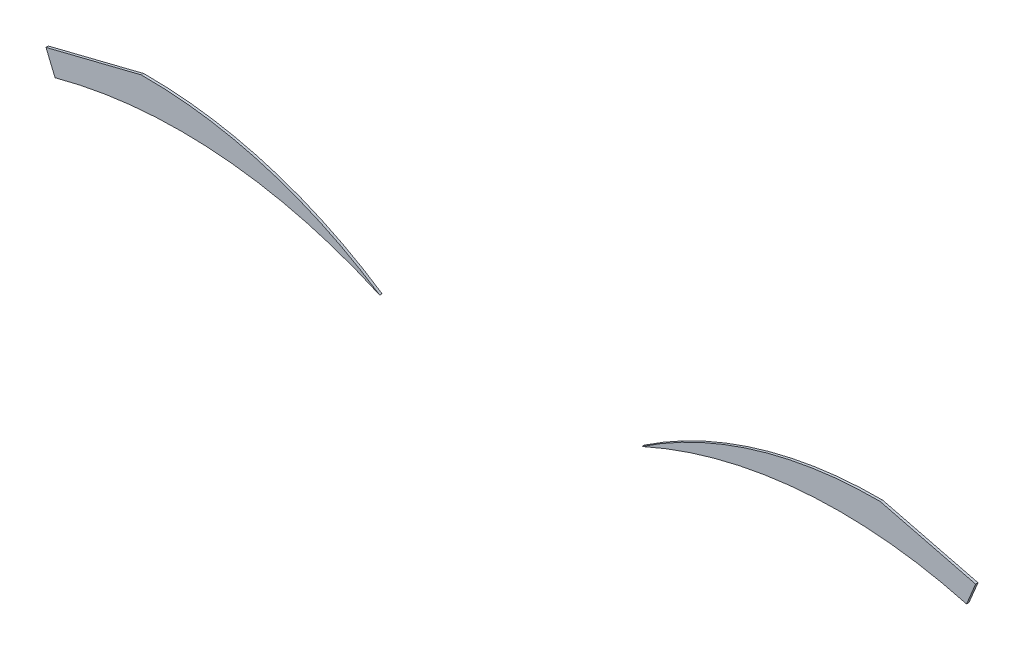
ISO-10303-21;
HEADER;
FILE_DESCRIPTION(('STEP AP214'),'2;1');
FILE_NAME('part.step','',(''),(''),'','','');
FILE_SCHEMA(('AUTOMOTIVE_DESIGN { 1 0 10303 214 1 1 1 1 }'));
ENDSEC;
DATA;
#1=APPLICATION_CONTEXT('core data for automotive mechanical design processes');
#2=APPLICATION_PROTOCOL_DEFINITION('international standard','automotive_design',2000,#1);
#3=PRODUCT_CONTEXT('',#1,'mechanical');
#4=PRODUCT('Part','Part','',(#3));
#5=PRODUCT_RELATED_PRODUCT_CATEGORY('part','',(#4));
#6=PRODUCT_DEFINITION_FORMATION('','',#4);
#7=PRODUCT_DEFINITION_CONTEXT('part definition',#1,'design');
#8=PRODUCT_DEFINITION('design','',#6,#7);
#9=PRODUCT_DEFINITION_SHAPE('','',#8);
#10=(LENGTH_UNIT() NAMED_UNIT(*) SI_UNIT(.MILLI.,.METRE.));
#11=(NAMED_UNIT(*) PLANE_ANGLE_UNIT() SI_UNIT($,.RADIAN.));
#12=(NAMED_UNIT(*) SI_UNIT($,.STERADIAN.) SOLID_ANGLE_UNIT());
#13=UNCERTAINTY_MEASURE_WITH_UNIT(LENGTH_MEASURE(1.E-05),#10,'distance_accuracy_value','');
#14=(GEOMETRIC_REPRESENTATION_CONTEXT(3) GLOBAL_UNCERTAINTY_ASSIGNED_CONTEXT((#13)) GLOBAL_UNIT_ASSIGNED_CONTEXT((#10,
#11,#12)) REPRESENTATION_CONTEXT('',''));
#15=CARTESIAN_POINT('',(0.,0.,0.));
#16=DIRECTION('',(0.,0.,1.));
#17=DIRECTION('',(1.,0.,0.));
#18=AXIS2_PLACEMENT_3D('',#15,#16,#17);
#19=CARTESIAN_POINT('',(63.8226682832925,13.099457039687,0.1));
#20=DIRECTION('',(0.,0.,-1.));
#21=DIRECTION('',(-1.,0.,0.));
#22=AXIS2_PLACEMENT_3D('',#19,#20,#21);
#23=CYLINDRICAL_SURFACE('',#22,20.1944982778834);
#24=CARTESIAN_POINT('',(63.8226682832925,13.099457039687,0.));
#25=DIRECTION('',(0.,0.,-1.));
#26=DIRECTION('',(1.,0.,0.));
#27=AXIS2_PLACEMENT_3D('',#24,#25,#26);
#28=CIRCLE('',#27,20.1944982778834);
#29=CARTESIAN_POINT('',(55.5012574568279,31.4997799323059,0.));
#30=VERTEX_POINT('',#29);
#31=CARTESIAN_POINT('',(69.1208745635678,32.586549457672,0.));
#32=VERTEX_POINT('',#31);
#33=EDGE_CURVE('E106',#30,#32,#28,.T.);
#34=ORIENTED_EDGE('',*,*,#33,.T.);
#35=DIRECTION('',(0.,0.,-1.));
#36=VECTOR('',#35,1.);
#37=CARTESIAN_POINT('',(69.1208745635678,32.586549457672,0.1));
#38=LINE('',#37,#36);
#39=CARTESIAN_POINT('',(69.1208745635678,32.586549457672,0.1));
#40=VERTEX_POINT('',#39);
#41=EDGE_CURVE('E12',#40,#32,#38,.T.);
#42=ORIENTED_EDGE('',*,*,#41,.F.);
#43=CARTESIAN_POINT('',(63.8226682832925,13.099457039687,0.1));
#44=DIRECTION('',(0.,0.,-1.));
#45=DIRECTION('',(1.,0.,0.));
#46=AXIS2_PLACEMENT_3D('',#43,#44,#45);
#47=CIRCLE('',#46,20.1944982778834);
#48=CARTESIAN_POINT('',(55.5012574568279,31.4997799323059,0.1));
#49=VERTEX_POINT('',#48);
#50=EDGE_CURVE('E94',#49,#40,#47,.T.);
#51=ORIENTED_EDGE('',*,*,#50,.F.);
#52=DIRECTION('',(0.,0.,-1.));
#53=VECTOR('',#52,1.);
#54=CARTESIAN_POINT('',(55.5012574568279,31.4997799323059,0.1));
#55=LINE('',#54,#53);
#56=EDGE_CURVE('E102',#49,#30,#55,.T.);
#57=ORIENTED_EDGE('',*,*,#56,.T.);
#58=EDGE_LOOP('',(#34,#42,#51,#57));
#59=FACE_BOUND('',#58,.T.);
#60=ADVANCED_FACE('F43',(#59),#23,.F.);
#61=CARTESIAN_POINT('',(69.5012574568278,33.4997799323059,0.1));
#62=DIRECTION('',(-0.923123499978437,0.384503580981453,0.));
#63=DIRECTION('',(-0.384503580981453,-0.923123499978437,0.));
#64=AXIS2_PLACEMENT_3D('',#61,#62,#63);
#65=PLANE('',#64);
#66=DIRECTION('',(0.384503580981453,0.923123499978437,0.));
#67=VECTOR('',#66,1.);
#68=CARTESIAN_POINT('',(69.5012574568278,33.4997799323059,0.));
#69=LINE('',#68,#67);
#70=CARTESIAN_POINT('',(69.5012574568278,33.4997799323059,0.));
#71=VERTEX_POINT('',#70);
#72=EDGE_CURVE('E98',#32,#71,#69,.T.);
#73=ORIENTED_EDGE('',*,*,#72,.T.);
#74=DIRECTION('',(0.,0.,-1.));
#75=VECTOR('',#74,1.);
#76=CARTESIAN_POINT('',(69.5012574568278,33.4997799323059,0.1));
#77=LINE('',#76,#75);
#78=CARTESIAN_POINT('',(69.5012574568278,33.4997799323059,0.1));
#79=VERTEX_POINT('',#78);
#80=EDGE_CURVE('E51',#79,#71,#77,.T.);
#81=ORIENTED_EDGE('',*,*,#80,.F.);
#82=DIRECTION('',(0.384503580981453,0.923123499978437,0.));
#83=VECTOR('',#82,1.);
#84=CARTESIAN_POINT('',(69.5012574568278,33.4997799323059,0.1));
#85=LINE('',#84,#83);
#86=EDGE_CURVE('E89',#40,#79,#85,.T.);
#87=ORIENTED_EDGE('',*,*,#86,.F.);
#88=ORIENTED_EDGE('',*,*,#41,.T.);
#89=EDGE_LOOP('',(#73,#81,#87,#88));
#90=FACE_BOUND('',#89,.T.);
#91=ADVANCED_FACE('F97',(#90),#65,.F.);
#92=CARTESIAN_POINT('',(65.5012574568278,34.4997799323059,0.1));
#93=DIRECTION('',(-0.242535625036333,-0.970142500145332,0.));
#94=DIRECTION('',(0.970142500145332,-0.242535625036333,0.));
#95=AXIS2_PLACEMENT_3D('',#92,#93,#94);
#96=PLANE('',#95);
#97=DIRECTION('',(-0.970142500145332,0.242535625036333,0.));
#98=VECTOR('',#97,1.);
#99=CARTESIAN_POINT('',(65.5012574568278,34.4997799323059,0.));
#100=LINE('',#99,#98);
#101=CARTESIAN_POINT('',(65.5012574568278,34.4997799323059,0.));
#102=VERTEX_POINT('',#101);
#103=EDGE_CURVE('E76',#71,#102,#100,.T.);
#104=ORIENTED_EDGE('',*,*,#103,.T.);
#105=DIRECTION('',(0.,0.,-1.));
#106=VECTOR('',#105,1.);
#107=CARTESIAN_POINT('',(65.5012574568278,34.4997799323059,0.1));
#108=LINE('',#107,#106);
#109=CARTESIAN_POINT('',(65.5012574568278,34.4997799323059,0.1));
#110=VERTEX_POINT('',#109);
#111=EDGE_CURVE('E99',#110,#102,#108,.T.);
#112=ORIENTED_EDGE('',*,*,#111,.F.);
#113=DIRECTION('',(-0.970142500145332,0.242535625036333,0.));
#114=VECTOR('',#113,1.);
#115=CARTESIAN_POINT('',(65.5012574568278,34.4997799323059,0.1));
#116=LINE('',#115,#114);
#117=EDGE_CURVE('E92',#79,#110,#116,.T.);
#118=ORIENTED_EDGE('',*,*,#117,.F.);
#119=ORIENTED_EDGE('',*,*,#80,.T.);
#120=EDGE_LOOP('',(#104,#112,#118,#119));
#121=FACE_BOUND('',#120,.T.);
#122=ADVANCED_FACE('F100',(#121),#96,.F.);
#123=CARTESIAN_POINT('',(65.3762574568279,16.7497799323057,0.1));
#124=DIRECTION('',(0.,0.,-1.));
#125=DIRECTION('',(-1.,0.,0.));
#126=AXIS2_PLACEMENT_3D('',#123,#124,#125);
#127=CYLINDRICAL_SURFACE('',#126,17.7504401353884);
#128=CARTESIAN_POINT('',(65.3762574568279,16.7497799323057,0.));
#129=DIRECTION('',(0.,0.,1.));
#130=DIRECTION('',(1.,0.,0.));
#131=AXIS2_PLACEMENT_3D('',#128,#129,#130);
#132=CIRCLE('',#131,17.7504401353884);
#133=EDGE_CURVE('E82',#102,#30,#132,.T.);
#134=ORIENTED_EDGE('',*,*,#133,.T.);
#135=ORIENTED_EDGE('',*,*,#56,.F.);
#136=CARTESIAN_POINT('',(65.3762574568279,16.7497799323057,0.1));
#137=DIRECTION('',(0.,0.,1.));
#138=DIRECTION('',(1.,0.,0.));
#139=AXIS2_PLACEMENT_3D('',#136,#137,#138);
#140=CIRCLE('',#139,17.7504401353884);
#141=EDGE_CURVE('E59',#110,#49,#140,.T.);
#142=ORIENTED_EDGE('',*,*,#141,.F.);
#143=ORIENTED_EDGE('',*,*,#111,.T.);
#144=EDGE_LOOP('',(#134,#135,#142,#143));
#145=FACE_BOUND('',#144,.T.);
#146=ADVANCED_FACE('F113',(#145),#127,.T.);
#147=CARTESIAN_POINT('',(63.8226682832925,13.099457039687,0.1));
#148=DIRECTION('',(0.,0.,1.));
#149=DIRECTION('',(1.,0.,0.));
#150=AXIS2_PLACEMENT_3D('',#147,#148,#149);
#151=PLANE('',#150);
#152=ORIENTED_EDGE('',*,*,#50,.T.);
#153=ORIENTED_EDGE('',*,*,#86,.T.);
#154=ORIENTED_EDGE('',*,*,#117,.T.);
#155=ORIENTED_EDGE('',*,*,#141,.T.);
#156=EDGE_LOOP('',(#152,#153,#154,#155));
#157=FACE_BOUND('',#156,.T.);
#158=ADVANCED_FACE('F90',(#157),#151,.T.);
#159=CARTESIAN_POINT('',(63.8226682832925,13.099457039687,0.));
#160=DIRECTION('',(0.,0.,1.));
#161=DIRECTION('',(1.,0.,0.));
#162=AXIS2_PLACEMENT_3D('',#159,#160,#161);
#163=PLANE('',#162);
#164=ORIENTED_EDGE('',*,*,#33,.F.);
#165=ORIENTED_EDGE('',*,*,#133,.F.);
#166=ORIENTED_EDGE('',*,*,#103,.F.);
#167=ORIENTED_EDGE('',*,*,#72,.F.);
#168=EDGE_LOOP('',(#164,#165,#166,#167));
#169=FACE_BOUND('',#168,.T.);
#170=ADVANCED_FACE('F116',(#169),#163,.F.);
#171=CLOSED_SHELL('',(#60,#91,#122,#146,#158,#170));
#172=MANIFOLD_SOLID_BREP('B2',#171);
#173=CARTESIAN_POINT('',(34.6237425431721,16.7497799323057,0.1));
#174=DIRECTION('',(0.,0.,-1.));
#175=DIRECTION('',(-1.,0.,0.));
#176=AXIS2_PLACEMENT_3D('',#173,#174,#175);
#177=CYLINDRICAL_SURFACE('',#176,17.7504401353884);
#178=CARTESIAN_POINT('',(34.6237425431721,16.7497799323057,0.));
#179=DIRECTION('',(0.,0.,1.));
#180=DIRECTION('',(1.,0.,0.));
#181=AXIS2_PLACEMENT_3D('',#178,#179,#180);
#182=CIRCLE('',#181,17.7504401353884);
#183=CARTESIAN_POINT('',(44.4987425431721,31.4997799323059,0.));
#184=VERTEX_POINT('',#183);
#185=CARTESIAN_POINT('',(34.4987425431722,34.4997799323059,0.));
#186=VERTEX_POINT('',#185);
#187=EDGE_CURVE('E230',#184,#186,#182,.T.);
#188=ORIENTED_EDGE('',*,*,#187,.T.);
#189=DIRECTION('',(0.,0.,-1.));
#190=VECTOR('',#189,1.);
#191=CARTESIAN_POINT('',(34.4987425431722,34.4997799323059,0.1));
#192=LINE('',#191,#190);
#193=CARTESIAN_POINT('',(34.4987425431722,34.4997799323059,0.1));
#194=VERTEX_POINT('',#193);
#195=EDGE_CURVE('E41',#194,#186,#192,.T.);
#196=ORIENTED_EDGE('',*,*,#195,.F.);
#197=CARTESIAN_POINT('',(34.6237425431721,16.7497799323057,0.1));
#198=DIRECTION('',(0.,0.,1.));
#199=DIRECTION('',(1.,0.,0.));
#200=AXIS2_PLACEMENT_3D('',#197,#198,#199);
#201=CIRCLE('',#200,17.7504401353884);
#202=CARTESIAN_POINT('',(44.4987425431721,31.4997799323059,0.1));
#203=VERTEX_POINT('',#202);
#204=EDGE_CURVE('E218',#203,#194,#201,.T.);
#205=ORIENTED_EDGE('',*,*,#204,.F.);
#206=DIRECTION('',(0.,0.,-1.));
#207=VECTOR('',#206,1.);
#208=CARTESIAN_POINT('',(44.4987425431721,31.4997799323059,0.1));
#209=LINE('',#208,#207);
#210=EDGE_CURVE('E226',#203,#184,#209,.T.);
#211=ORIENTED_EDGE('',*,*,#210,.T.);
#212=EDGE_LOOP('',(#188,#196,#205,#211));
#213=FACE_BOUND('',#212,.T.);
#214=ADVANCED_FACE('F167',(#213),#177,.T.);
#215=CARTESIAN_POINT('',(30.4987425431722,33.4997799323059,0.1));
#216=DIRECTION('',(0.242535625036333,-0.970142500145332,0.));
#217=DIRECTION('',(0.970142500145332,0.242535625036333,0.));
#218=AXIS2_PLACEMENT_3D('',#215,#216,#217);
#219=PLANE('',#218);
#220=DIRECTION('',(-0.970142500145332,-0.242535625036333,0.));
#221=VECTOR('',#220,1.);
#222=CARTESIAN_POINT('',(30.4987425431722,33.4997799323059,0.));
#223=LINE('',#222,#221);
#224=CARTESIAN_POINT('',(30.4987425431722,33.4997799323059,0.));
#225=VERTEX_POINT('',#224);
#226=EDGE_CURVE('E222',#186,#225,#223,.T.);
#227=ORIENTED_EDGE('',*,*,#226,.T.);
#228=DIRECTION('',(0.,0.,-1.));
#229=VECTOR('',#228,1.);
#230=CARTESIAN_POINT('',(30.4987425431722,33.4997799323059,0.1));
#231=LINE('',#230,#229);
#232=CARTESIAN_POINT('',(30.4987425431722,33.4997799323059,0.1));
#233=VERTEX_POINT('',#232);
#234=EDGE_CURVE('E175',#233,#225,#231,.T.);
#235=ORIENTED_EDGE('',*,*,#234,.F.);
#236=DIRECTION('',(-0.970142500145332,-0.242535625036333,0.));
#237=VECTOR('',#236,1.);
#238=CARTESIAN_POINT('',(30.4987425431722,33.4997799323059,0.1));
#239=LINE('',#238,#237);
#240=EDGE_CURVE('E213',#194,#233,#239,.T.);
#241=ORIENTED_EDGE('',*,*,#240,.F.);
#242=ORIENTED_EDGE('',*,*,#195,.T.);
#243=EDGE_LOOP('',(#227,#235,#241,#242));
#244=FACE_BOUND('',#243,.T.);
#245=ADVANCED_FACE('F221',(#244),#219,.F.);
#246=CARTESIAN_POINT('',(30.8791254364322,32.586549457672,0.1));
#247=DIRECTION('',(0.923123499978423,0.384503580981485,0.));
#248=DIRECTION('',(-0.384503580981485,0.923123499978424,0.));
#249=AXIS2_PLACEMENT_3D('',#246,#247,#248);
#250=PLANE('',#249);
#251=DIRECTION('',(0.384503580981485,-0.923123499978423,0.));
#252=VECTOR('',#251,1.);
#253=CARTESIAN_POINT('',(30.8791254364322,32.586549457672,0.));
#254=LINE('',#253,#252);
#255=CARTESIAN_POINT('',(30.8791254364322,32.586549457672,0.));
#256=VERTEX_POINT('',#255);
#257=EDGE_CURVE('E200',#225,#256,#254,.T.);
#258=ORIENTED_EDGE('',*,*,#257,.T.);
#259=DIRECTION('',(0.,0.,-1.));
#260=VECTOR('',#259,1.);
#261=CARTESIAN_POINT('',(30.8791254364322,32.586549457672,0.1));
#262=LINE('',#261,#260);
#263=CARTESIAN_POINT('',(30.8791254364322,32.586549457672,0.1));
#264=VERTEX_POINT('',#263);
#265=EDGE_CURVE('E223',#264,#256,#262,.T.);
#266=ORIENTED_EDGE('',*,*,#265,.F.);
#267=DIRECTION('',(0.384503580981485,-0.923123499978423,0.));
#268=VECTOR('',#267,1.);
#269=CARTESIAN_POINT('',(30.8791254364322,32.586549457672,0.1));
#270=LINE('',#269,#268);
#271=EDGE_CURVE('E216',#233,#264,#270,.T.);
#272=ORIENTED_EDGE('',*,*,#271,.F.);
#273=ORIENTED_EDGE('',*,*,#234,.T.);
#274=EDGE_LOOP('',(#258,#266,#272,#273));
#275=FACE_BOUND('',#274,.T.);
#276=ADVANCED_FACE('F224',(#275),#250,.F.);
#277=CARTESIAN_POINT('',(36.1773317167075,13.0994570396871,0.1));
#278=DIRECTION('',(0.,0.,-1.));
#279=DIRECTION('',(-1.,0.,0.));
#280=AXIS2_PLACEMENT_3D('',#277,#278,#279);
#281=CYLINDRICAL_SURFACE('',#280,20.1944982778834);
#282=CARTESIAN_POINT('',(36.1773317167075,13.0994570396871,0.));
#283=DIRECTION('',(0.,0.,-1.));
#284=DIRECTION('',(1.,0.,0.));
#285=AXIS2_PLACEMENT_3D('',#282,#283,#284);
#286=CIRCLE('',#285,20.1944982778834);
#287=EDGE_CURVE('E206',#256,#184,#286,.T.);
#288=ORIENTED_EDGE('',*,*,#287,.T.);
#289=ORIENTED_EDGE('',*,*,#210,.F.);
#290=CARTESIAN_POINT('',(36.1773317167075,13.0994570396871,0.1));
#291=DIRECTION('',(0.,0.,-1.));
#292=DIRECTION('',(1.,0.,0.));
#293=AXIS2_PLACEMENT_3D('',#290,#291,#292);
#294=CIRCLE('',#293,20.1944982778834);
#295=EDGE_CURVE('E183',#264,#203,#294,.T.);
#296=ORIENTED_EDGE('',*,*,#295,.F.);
#297=ORIENTED_EDGE('',*,*,#265,.T.);
#298=EDGE_LOOP('',(#288,#289,#296,#297));
#299=FACE_BOUND('',#298,.T.);
#300=ADVANCED_FACE('F237',(#299),#281,.F.);
#301=CARTESIAN_POINT('',(34.6237425431721,16.7497799323057,0.1));
#302=DIRECTION('',(0.,0.,1.));
#303=DIRECTION('',(1.,0.,0.));
#304=AXIS2_PLACEMENT_3D('',#301,#302,#303);
#305=PLANE('',#304);
#306=ORIENTED_EDGE('',*,*,#204,.T.);
#307=ORIENTED_EDGE('',*,*,#240,.T.);
#308=ORIENTED_EDGE('',*,*,#271,.T.);
#309=ORIENTED_EDGE('',*,*,#295,.T.);
#310=EDGE_LOOP('',(#306,#307,#308,#309));
#311=FACE_BOUND('',#310,.T.);
#312=ADVANCED_FACE('F214',(#311),#305,.T.);
#313=CARTESIAN_POINT('',(34.6237425431721,16.7497799323057,0.));
#314=DIRECTION('',(0.,0.,1.));
#315=DIRECTION('',(1.,0.,0.));
#316=AXIS2_PLACEMENT_3D('',#313,#314,#315);
#317=PLANE('',#316);
#318=ORIENTED_EDGE('',*,*,#187,.F.);
#319=ORIENTED_EDGE('',*,*,#287,.F.);
#320=ORIENTED_EDGE('',*,*,#257,.F.);
#321=ORIENTED_EDGE('',*,*,#226,.F.);
#322=EDGE_LOOP('',(#318,#319,#320,#321));
#323=FACE_BOUND('',#322,.T.);
#324=ADVANCED_FACE('F240',(#323),#317,.F.);
#325=CLOSED_SHELL('',(#214,#245,#276,#300,#312,#324));
#326=MANIFOLD_SOLID_BREP('B6',#325);
#327=ADVANCED_BREP_SHAPE_REPRESENTATION('',(#18,#172,#326),#14);
#328=SHAPE_DEFINITION_REPRESENTATION(#9,#327);
ENDSEC;
END-ISO-10303-21;
